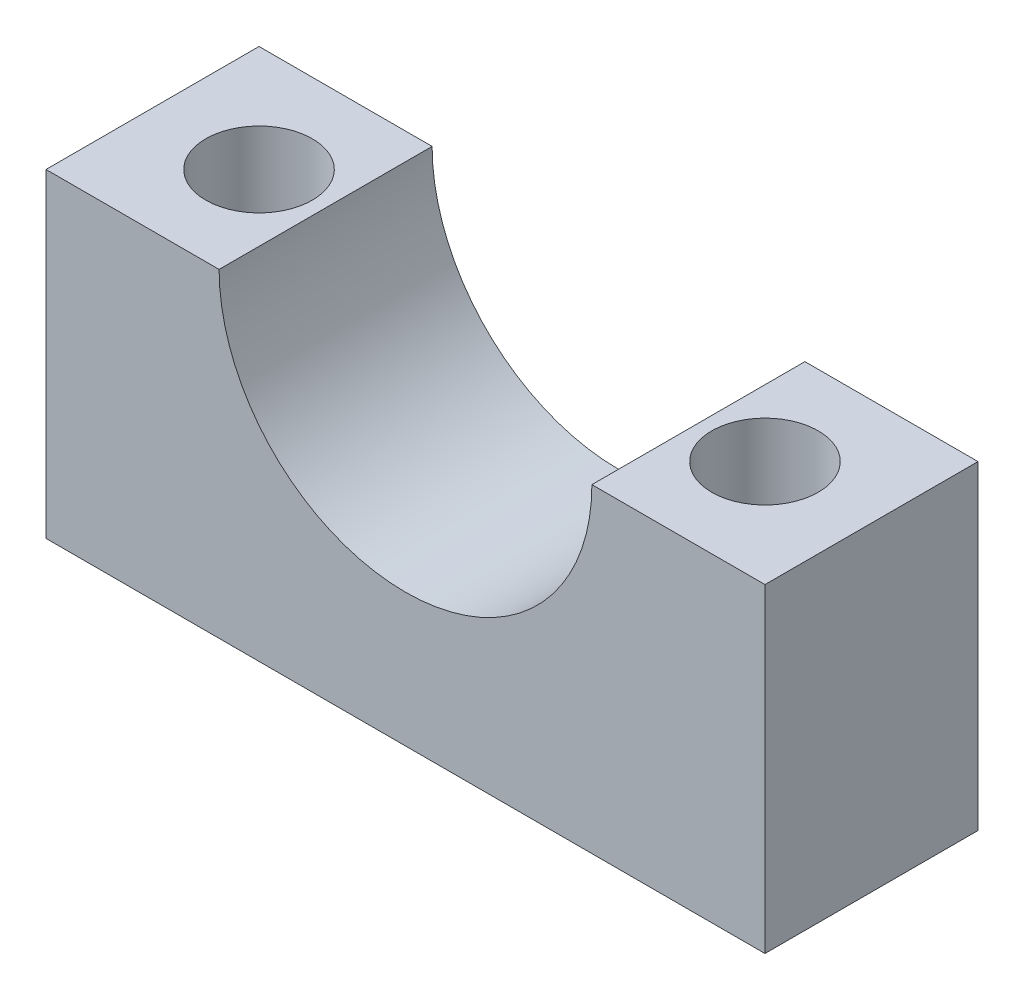
ISO-10303-21;
HEADER;
FILE_DESCRIPTION(('STEP AP214'),'2;1');
FILE_NAME('part.step','',(''),(''),'','','');
FILE_SCHEMA(('AUTOMOTIVE_DESIGN { 1 0 10303 214 1 1 1 1 }'));
ENDSEC;
DATA;
#1=APPLICATION_CONTEXT('core data for automotive mechanical design processes');
#2=APPLICATION_PROTOCOL_DEFINITION('international standard','automotive_design',2000,#1);
#3=PRODUCT_CONTEXT('',#1,'mechanical');
#4=PRODUCT('Part','Part','',(#3));
#5=PRODUCT_RELATED_PRODUCT_CATEGORY('part','',(#4));
#6=PRODUCT_DEFINITION_FORMATION('','',#4);
#7=PRODUCT_DEFINITION_CONTEXT('part definition',#1,'design');
#8=PRODUCT_DEFINITION('design','',#6,#7);
#9=PRODUCT_DEFINITION_SHAPE('','',#8);
#10=(LENGTH_UNIT() NAMED_UNIT(*) SI_UNIT(.MILLI.,.METRE.));
#11=(NAMED_UNIT(*) PLANE_ANGLE_UNIT() SI_UNIT($,.RADIAN.));
#12=(NAMED_UNIT(*) SI_UNIT($,.STERADIAN.) SOLID_ANGLE_UNIT());
#13=UNCERTAINTY_MEASURE_WITH_UNIT(LENGTH_MEASURE(1.E-05),#10,'distance_accuracy_value','');
#14=(GEOMETRIC_REPRESENTATION_CONTEXT(3) GLOBAL_UNCERTAINTY_ASSIGNED_CONTEXT((#13)) GLOBAL_UNIT_ASSIGNED_CONTEXT((#10,
#11,#12)) REPRESENTATION_CONTEXT('',''));
#15=CARTESIAN_POINT('',(0.,0.,0.));
#16=DIRECTION('',(0.,0.,1.));
#17=DIRECTION('',(1.,0.,0.));
#18=AXIS2_PLACEMENT_3D('',#15,#16,#17);
#19=CARTESIAN_POINT('',(5.61400651465799,10.0846905537459,8.));
#20=DIRECTION('',(0.,0.,-1.));
#21=DIRECTION('',(-1.,0.,0.));
#22=AXIS2_PLACEMENT_3D('',#19,#20,#21);
#23=CYLINDRICAL_SURFACE('',#22,7.);
#24=CARTESIAN_POINT('',(5.61400651465799,10.0846905537459,0.));
#25=DIRECTION('',(0.,0.,1.));
#26=DIRECTION('',(1.,0.,0.));
#27=AXIS2_PLACEMENT_3D('',#24,#25,#26);
#28=CIRCLE('',#27,7.);
#29=CARTESIAN_POINT('',(-1.38599348534202,10.0846905537459,0.));
#30=VERTEX_POINT('',#29);
#31=CARTESIAN_POINT('',(12.614006514658,10.0846905537459,0.));
#32=VERTEX_POINT('',#31);
#33=EDGE_CURVE('E134',#30,#32,#28,.T.);
#34=ORIENTED_EDGE('',*,*,#33,.F.);
#35=DIRECTION('',(0.,0.,-1.));
#36=VECTOR('',#35,1.);
#37=CARTESIAN_POINT('',(-1.38599348534202,10.0846905537459,8.));
#38=LINE('',#37,#36);
#39=CARTESIAN_POINT('',(-1.38599348534202,10.0846905537459,8.));
#40=VERTEX_POINT('',#39);
#41=EDGE_CURVE('E11',#40,#30,#38,.T.);
#42=ORIENTED_EDGE('',*,*,#41,.F.);
#43=CARTESIAN_POINT('',(5.61400651465799,10.0846905537459,8.));
#44=DIRECTION('',(0.,0.,1.));
#45=DIRECTION('',(1.,0.,0.));
#46=AXIS2_PLACEMENT_3D('',#43,#44,#45);
#47=CIRCLE('',#46,7.);
#48=CARTESIAN_POINT('',(12.614006514658,10.0846905537459,8.));
#49=VERTEX_POINT('',#48);
#50=EDGE_CURVE('E169',#40,#49,#47,.T.);
#51=ORIENTED_EDGE('',*,*,#50,.T.);
#52=DIRECTION('',(0.,0.,-1.));
#53=VECTOR('',#52,1.);
#54=CARTESIAN_POINT('',(12.614006514658,10.0846905537459,8.));
#55=LINE('',#54,#53);
#56=EDGE_CURVE('E64',#49,#32,#55,.T.);
#57=ORIENTED_EDGE('',*,*,#56,.T.);
#58=EDGE_LOOP('',(#34,#42,#51,#57));
#59=FACE_BOUND('',#58,.T.);
#60=ADVANCED_FACE('F47',(#59),#23,.F.);
#61=CARTESIAN_POINT('',(0.,10.0846905537459,8.));
#62=DIRECTION('',(0.,1.,0.));
#63=DIRECTION('',(0.,0.,1.));
#64=AXIS2_PLACEMENT_3D('',#61,#62,#63);
#65=PLANE('',#64);
#66=CARTESIAN_POINT('',(-3.88599348534201,10.0846905537459,4.));
#67=DIRECTION('',(0.,1.,0.));
#68=DIRECTION('',(0.,0.,1.));
#69=AXIS2_PLACEMENT_3D('',#66,#67,#68);
#70=CIRCLE('',#69,2.);
#71=CARTESIAN_POINT('',(-3.88599348534201,10.0846905537459,6.));
#72=VERTEX_POINT('',#71);
#73=EDGE_CURVE('E183',#72,#72,#70,.T.);
#74=ORIENTED_EDGE('',*,*,#73,.F.);
#75=EDGE_LOOP('',(#74));
#76=FACE_BOUND('',#75,.T.);
#77=DIRECTION('',(1.,0.,0.));
#78=VECTOR('',#77,1.);
#79=CARTESIAN_POINT('',(0.,10.0846905537459,0.));
#80=LINE('',#79,#78);
#81=CARTESIAN_POINT('',(-7.88599348534201,10.0846905537459,0.));
#82=VERTEX_POINT('',#81);
#83=EDGE_CURVE('E137',#82,#30,#80,.T.);
#84=ORIENTED_EDGE('',*,*,#83,.F.);
#85=DIRECTION('',(0.,0.,-1.));
#86=VECTOR('',#85,1.);
#87=CARTESIAN_POINT('',(-7.88599348534201,10.0846905537459,8.));
#88=LINE('',#87,#86);
#89=CARTESIAN_POINT('',(-7.88599348534201,10.0846905537459,8.));
#90=VERTEX_POINT('',#89);
#91=EDGE_CURVE('E56',#90,#82,#88,.T.);
#92=ORIENTED_EDGE('',*,*,#91,.F.);
#93=DIRECTION('',(1.,0.,0.));
#94=VECTOR('',#93,1.);
#95=CARTESIAN_POINT('',(0.,10.0846905537459,8.));
#96=LINE('',#95,#94);
#97=EDGE_CURVE('E131',#90,#40,#96,.T.);
#98=ORIENTED_EDGE('',*,*,#97,.T.);
#99=ORIENTED_EDGE('',*,*,#41,.T.);
#100=EDGE_LOOP('',(#84,#92,#98,#99));
#101=FACE_BOUND('',#100,.T.);
#102=ADVANCED_FACE('F164',(#76,#101),#65,.T.);
#103=CARTESIAN_POINT('',(-7.88599348534201,0.,8.));
#104=DIRECTION('',(-1.,0.,0.));
#105=DIRECTION('',(0.,0.,1.));
#106=AXIS2_PLACEMENT_3D('',#103,#104,#105);
#107=PLANE('',#106);
#108=DIRECTION('',(0.,1.,0.));
#109=VECTOR('',#108,1.);
#110=CARTESIAN_POINT('',(-7.88599348534201,0.,0.));
#111=LINE('',#110,#109);
#112=CARTESIAN_POINT('',(-7.88599348534201,-1.91530944625407,0.));
#113=VERTEX_POINT('',#112);
#114=EDGE_CURVE('E142',#113,#82,#111,.T.);
#115=ORIENTED_EDGE('',*,*,#114,.F.);
#116=DIRECTION('',(0.,0.,-1.));
#117=VECTOR('',#116,1.);
#118=CARTESIAN_POINT('',(-7.88599348534201,-1.91530944625407,8.));
#119=LINE('',#118,#117);
#120=CARTESIAN_POINT('',(-7.88599348534201,-1.91530944625407,8.));
#121=VERTEX_POINT('',#120);
#122=EDGE_CURVE('E123',#121,#113,#119,.T.);
#123=ORIENTED_EDGE('',*,*,#122,.F.);
#124=DIRECTION('',(0.,1.,0.));
#125=VECTOR('',#124,1.);
#126=CARTESIAN_POINT('',(-7.88599348534201,0.,8.));
#127=LINE('',#126,#125);
#128=EDGE_CURVE('E111',#121,#90,#127,.T.);
#129=ORIENTED_EDGE('',*,*,#128,.T.);
#130=ORIENTED_EDGE('',*,*,#91,.T.);
#131=EDGE_LOOP('',(#115,#123,#129,#130));
#132=FACE_BOUND('',#131,.T.);
#133=ADVANCED_FACE('F161',(#132),#107,.T.);
#134=CARTESIAN_POINT('',(0.,-1.91530944625407,8.));
#135=DIRECTION('',(0.,1.,0.));
#136=DIRECTION('',(0.,0.,1.));
#137=AXIS2_PLACEMENT_3D('',#134,#135,#136);
#138=PLANE('',#137);
#139=CARTESIAN_POINT('',(-3.88599348534201,-1.91530944625407,4.));
#140=DIRECTION('',(0.,1.,0.));
#141=DIRECTION('',(0.,0.,1.));
#142=AXIS2_PLACEMENT_3D('',#139,#140,#141);
#143=CIRCLE('',#142,2.);
#144=CARTESIAN_POINT('',(-3.88599348534201,-1.91530944625407,6.));
#145=VERTEX_POINT('',#144);
#146=EDGE_CURVE('E138',#145,#145,#143,.T.);
#147=ORIENTED_EDGE('',*,*,#146,.T.);
#148=EDGE_LOOP('',(#147));
#149=FACE_BOUND('',#148,.T.);
#150=CARTESIAN_POINT('',(15.114006514658,-1.91530944625407,4.));
#151=DIRECTION('',(0.,1.,0.));
#152=DIRECTION('',(0.,0.,1.));
#153=AXIS2_PLACEMENT_3D('',#150,#151,#152);
#154=CIRCLE('',#153,2.);
#155=CARTESIAN_POINT('',(15.114006514658,-1.91530944625407,6.));
#156=VERTEX_POINT('',#155);
#157=EDGE_CURVE('E174',#156,#156,#154,.T.);
#158=ORIENTED_EDGE('',*,*,#157,.T.);
#159=EDGE_LOOP('',(#158));
#160=FACE_BOUND('',#159,.T.);
#161=DIRECTION('',(1.,0.,0.));
#162=VECTOR('',#161,1.);
#163=CARTESIAN_POINT('',(0.,-1.91530944625407,0.));
#164=LINE('',#163,#162);
#165=CARTESIAN_POINT('',(19.114006514658,-1.91530944625407,0.));
#166=VERTEX_POINT('',#165);
#167=EDGE_CURVE('E119',#113,#166,#164,.T.);
#168=ORIENTED_EDGE('',*,*,#167,.T.);
#169=DIRECTION('',(0.,0.,-1.));
#170=VECTOR('',#169,1.);
#171=CARTESIAN_POINT('',(19.114006514658,-1.91530944625407,8.));
#172=LINE('',#171,#170);
#173=CARTESIAN_POINT('',(19.114006514658,-1.91530944625407,8.));
#174=VERTEX_POINT('',#173);
#175=EDGE_CURVE('E116',#174,#166,#172,.T.);
#176=ORIENTED_EDGE('',*,*,#175,.F.);
#177=DIRECTION('',(1.,0.,0.));
#178=VECTOR('',#177,1.);
#179=CARTESIAN_POINT('',(0.,-1.91530944625407,8.));
#180=LINE('',#179,#178);
#181=EDGE_CURVE('E103',#121,#174,#180,.T.);
#182=ORIENTED_EDGE('',*,*,#181,.F.);
#183=ORIENTED_EDGE('',*,*,#122,.T.);
#184=EDGE_LOOP('',(#168,#176,#182,#183));
#185=FACE_BOUND('',#184,.T.);
#186=ADVANCED_FACE('F117',(#149,#160,#185),#138,.F.);
#187=CARTESIAN_POINT('',(19.114006514658,0.,8.));
#188=DIRECTION('',(-1.,0.,0.));
#189=DIRECTION('',(0.,0.,1.));
#190=AXIS2_PLACEMENT_3D('',#187,#188,#189);
#191=PLANE('',#190);
#192=DIRECTION('',(0.,1.,0.));
#193=VECTOR('',#192,1.);
#194=CARTESIAN_POINT('',(19.114006514658,0.,0.));
#195=LINE('',#194,#193);
#196=CARTESIAN_POINT('',(19.114006514658,10.0846905537459,0.));
#197=VERTEX_POINT('',#196);
#198=EDGE_CURVE('E149',#166,#197,#195,.T.);
#199=ORIENTED_EDGE('',*,*,#198,.T.);
#200=DIRECTION('',(0.,0.,-1.));
#201=VECTOR('',#200,1.);
#202=CARTESIAN_POINT('',(19.114006514658,10.0846905537459,8.));
#203=LINE('',#202,#201);
#204=CARTESIAN_POINT('',(19.114006514658,10.0846905537459,8.));
#205=VERTEX_POINT('',#204);
#206=EDGE_CURVE('E84',#205,#197,#203,.T.);
#207=ORIENTED_EDGE('',*,*,#206,.F.);
#208=DIRECTION('',(0.,1.,0.));
#209=VECTOR('',#208,1.);
#210=CARTESIAN_POINT('',(19.114006514658,0.,8.));
#211=LINE('',#210,#209);
#212=EDGE_CURVE('E108',#174,#205,#211,.T.);
#213=ORIENTED_EDGE('',*,*,#212,.F.);
#214=ORIENTED_EDGE('',*,*,#175,.T.);
#215=EDGE_LOOP('',(#199,#207,#213,#214));
#216=FACE_BOUND('',#215,.T.);
#217=ADVANCED_FACE('F125',(#216),#191,.F.);
#218=CARTESIAN_POINT('',(15.114006514658,10.0846905537459,4.));
#219=DIRECTION('',(0.,1.,0.));
#220=DIRECTION('',(0.,0.,1.));
#221=AXIS2_PLACEMENT_3D('',#218,#219,#220);
#222=CIRCLE('',#221,2.);
#223=CARTESIAN_POINT('',(15.114006514658,10.0846905537459,6.));
#224=VERTEX_POINT('',#223);
#225=EDGE_CURVE('E179',#224,#224,#222,.T.);
#226=ORIENTED_EDGE('',*,*,#225,.F.);
#227=EDGE_LOOP('',(#226));
#228=FACE_BOUND('',#227,.T.);
#229=EDGE_CURVE('E143',#32,#197,#80,.T.);
#230=ORIENTED_EDGE('',*,*,#229,.F.);
#231=ORIENTED_EDGE('',*,*,#56,.F.);
#232=EDGE_CURVE('E127',#49,#205,#96,.T.);
#233=ORIENTED_EDGE('',*,*,#232,.T.);
#234=ORIENTED_EDGE('',*,*,#206,.T.);
#235=EDGE_LOOP('',(#230,#231,#233,#234));
#236=FACE_BOUND('',#235,.T.);
#237=ADVANCED_FACE('F202',(#228,#236),#65,.T.);
#238=CARTESIAN_POINT('',(0.,0.,8.));
#239=DIRECTION('',(0.,0.,1.));
#240=DIRECTION('',(1.,0.,0.));
#241=AXIS2_PLACEMENT_3D('',#238,#239,#240);
#242=PLANE('',#241);
#243=ORIENTED_EDGE('',*,*,#50,.F.);
#244=ORIENTED_EDGE('',*,*,#97,.F.);
#245=ORIENTED_EDGE('',*,*,#128,.F.);
#246=ORIENTED_EDGE('',*,*,#181,.T.);
#247=ORIENTED_EDGE('',*,*,#212,.T.);
#248=ORIENTED_EDGE('',*,*,#232,.F.);
#249=EDGE_LOOP('',(#243,#244,#245,#246,#247,#248));
#250=FACE_BOUND('',#249,.T.);
#251=ADVANCED_FACE('F105',(#250),#242,.T.);
#252=CARTESIAN_POINT('',(0.,0.,0.));
#253=DIRECTION('',(0.,0.,1.));
#254=DIRECTION('',(1.,0.,0.));
#255=AXIS2_PLACEMENT_3D('',#252,#253,#254);
#256=PLANE('',#255);
#257=ORIENTED_EDGE('',*,*,#33,.T.);
#258=ORIENTED_EDGE('',*,*,#229,.T.);
#259=ORIENTED_EDGE('',*,*,#198,.F.);
#260=ORIENTED_EDGE('',*,*,#167,.F.);
#261=ORIENTED_EDGE('',*,*,#114,.T.);
#262=ORIENTED_EDGE('',*,*,#83,.T.);
#263=EDGE_LOOP('',(#257,#258,#259,#260,#261,#262));
#264=FACE_BOUND('',#263,.T.);
#265=ADVANCED_FACE('F166',(#264),#256,.F.);
#266=CARTESIAN_POINT('',(15.114006514658,-1.91530944625407,4.));
#267=DIRECTION('',(0.,1.,0.));
#268=DIRECTION('',(0.,0.,1.));
#269=AXIS2_PLACEMENT_3D('',#266,#267,#268);
#270=CYLINDRICAL_SURFACE('',#269,2.);
#271=ORIENTED_EDGE('',*,*,#157,.F.);
#272=EDGE_LOOP('',(#271));
#273=FACE_BOUND('',#272,.T.);
#274=ORIENTED_EDGE('',*,*,#225,.T.);
#275=EDGE_LOOP('',(#274));
#276=FACE_BOUND('',#275,.T.);
#277=ADVANCED_FACE('F196',(#273,#276),#270,.F.);
#278=CARTESIAN_POINT('',(-3.88599348534201,-1.91530944625407,4.));
#279=DIRECTION('',(0.,1.,0.));
#280=DIRECTION('',(0.,0.,1.));
#281=AXIS2_PLACEMENT_3D('',#278,#279,#280);
#282=CYLINDRICAL_SURFACE('',#281,2.);
#283=ORIENTED_EDGE('',*,*,#146,.F.);
#284=EDGE_LOOP('',(#283));
#285=FACE_BOUND('',#284,.T.);
#286=ORIENTED_EDGE('',*,*,#73,.T.);
#287=EDGE_LOOP('',(#286));
#288=FACE_BOUND('',#287,.T.);
#289=ADVANCED_FACE('F193',(#285,#288),#282,.F.);
#290=CLOSED_SHELL('',(#60,#102,#133,#186,#217,#237,#251,#265,#277,#289));
#291=MANIFOLD_SOLID_BREP('B2',#290);
#292=ADVANCED_BREP_SHAPE_REPRESENTATION('',(#18,#291),#14);
#293=SHAPE_DEFINITION_REPRESENTATION(#9,#292);
ENDSEC;
END-ISO-10303-21;
